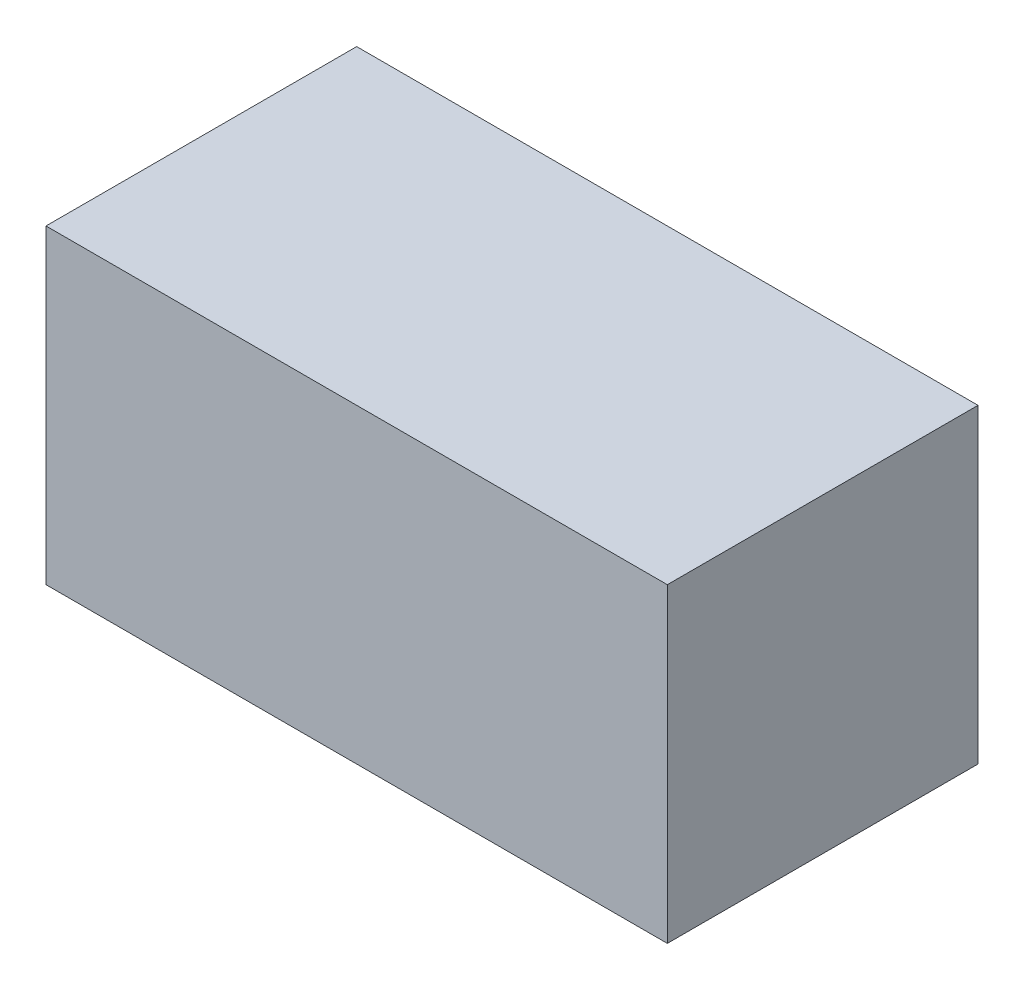
ISO-10303-21;
HEADER;
FILE_DESCRIPTION(('STEP AP214'),'2;1');
FILE_NAME('part.step','',(''),(''),'','','');
FILE_SCHEMA(('AUTOMOTIVE_DESIGN { 1 0 10303 214 1 1 1 1 }'));
ENDSEC;
DATA;
#1=APPLICATION_CONTEXT('core data for automotive mechanical design processes');
#2=APPLICATION_PROTOCOL_DEFINITION('international standard','automotive_design',2000,#1);
#3=PRODUCT_CONTEXT('',#1,'mechanical');
#4=PRODUCT('Part','Part','',(#3));
#5=PRODUCT_RELATED_PRODUCT_CATEGORY('part','',(#4));
#6=PRODUCT_DEFINITION_FORMATION('','',#4);
#7=PRODUCT_DEFINITION_CONTEXT('part definition',#1,'design');
#8=PRODUCT_DEFINITION('design','',#6,#7);
#9=PRODUCT_DEFINITION_SHAPE('','',#8);
#10=(LENGTH_UNIT() NAMED_UNIT(*) SI_UNIT(.MILLI.,.METRE.));
#11=(NAMED_UNIT(*) PLANE_ANGLE_UNIT() SI_UNIT($,.RADIAN.));
#12=(NAMED_UNIT(*) SI_UNIT($,.STERADIAN.) SOLID_ANGLE_UNIT());
#13=UNCERTAINTY_MEASURE_WITH_UNIT(LENGTH_MEASURE(1.E-05),#10,'distance_accuracy_value','');
#14=(GEOMETRIC_REPRESENTATION_CONTEXT(3) GLOBAL_UNCERTAINTY_ASSIGNED_CONTEXT((#13)) GLOBAL_UNIT_ASSIGNED_CONTEXT((#10,
#11,#12)) REPRESENTATION_CONTEXT('',''));
#15=CARTESIAN_POINT('',(0.,0.,0.));
#16=DIRECTION('',(0.,0.,1.));
#17=DIRECTION('',(1.,0.,0.));
#18=AXIS2_PLACEMENT_3D('',#15,#16,#17);
#19=CARTESIAN_POINT('',(15.,15.,-7.5));
#20=DIRECTION('',(-1.,0.,0.));
#21=DIRECTION('',(0.,0.,1.));
#22=AXIS2_PLACEMENT_3D('',#19,#20,#21);
#23=PLANE('',#22);
#24=DIRECTION('',(0.,0.,-1.));
#25=VECTOR('',#24,1.);
#26=CARTESIAN_POINT('',(15.,0.,-7.5));
#27=LINE('',#26,#25);
#28=CARTESIAN_POINT('',(15.,0.,7.5));
#29=VERTEX_POINT('',#28);
#30=CARTESIAN_POINT('',(15.,0.,-7.5));
#31=VERTEX_POINT('',#30);
#32=EDGE_CURVE('E96',#29,#31,#27,.T.);
#33=ORIENTED_EDGE('',*,*,#32,.T.);
#34=DIRECTION('',(0.,-1.,0.));
#35=VECTOR('',#34,1.);
#36=CARTESIAN_POINT('',(15.,15.,-7.5));
#37=LINE('',#36,#35);
#38=CARTESIAN_POINT('',(15.,15.,-7.5));
#39=VERTEX_POINT('',#38);
#40=EDGE_CURVE('E11',#39,#31,#37,.T.);
#41=ORIENTED_EDGE('',*,*,#40,.F.);
#42=DIRECTION('',(0.,0.,-1.));
#43=VECTOR('',#42,1.);
#44=CARTESIAN_POINT('',(15.,15.,-7.5));
#45=LINE('',#44,#43);
#46=CARTESIAN_POINT('',(15.,15.,7.5));
#47=VERTEX_POINT('',#46);
#48=EDGE_CURVE('E84',#47,#39,#45,.T.);
#49=ORIENTED_EDGE('',*,*,#48,.F.);
#50=DIRECTION('',(0.,-1.,0.));
#51=VECTOR('',#50,1.);
#52=CARTESIAN_POINT('',(15.,15.,7.5));
#53=LINE('',#52,#51);
#54=EDGE_CURVE('E92',#47,#29,#53,.T.);
#55=ORIENTED_EDGE('',*,*,#54,.T.);
#56=EDGE_LOOP('',(#33,#41,#49,#55));
#57=FACE_BOUND('',#56,.T.);
#58=ADVANCED_FACE('F33',(#57),#23,.F.);
#59=CARTESIAN_POINT('',(-15.,15.,-7.5));
#60=DIRECTION('',(0.,0.,1.));
#61=DIRECTION('',(1.,0.,0.));
#62=AXIS2_PLACEMENT_3D('',#59,#60,#61);
#63=PLANE('',#62);
#64=DIRECTION('',(-1.,0.,0.));
#65=VECTOR('',#64,1.);
#66=CARTESIAN_POINT('',(-15.,0.,-7.5));
#67=LINE('',#66,#65);
#68=CARTESIAN_POINT('',(-15.,0.,-7.5));
#69=VERTEX_POINT('',#68);
#70=EDGE_CURVE('E88',#31,#69,#67,.T.);
#71=ORIENTED_EDGE('',*,*,#70,.T.);
#72=DIRECTION('',(0.,-1.,0.));
#73=VECTOR('',#72,1.);
#74=CARTESIAN_POINT('',(-15.,15.,-7.5));
#75=LINE('',#74,#73);
#76=CARTESIAN_POINT('',(-15.,15.,-7.5));
#77=VERTEX_POINT('',#76);
#78=EDGE_CURVE('E41',#77,#69,#75,.T.);
#79=ORIENTED_EDGE('',*,*,#78,.F.);
#80=DIRECTION('',(-1.,0.,0.));
#81=VECTOR('',#80,1.);
#82=CARTESIAN_POINT('',(-15.,15.,-7.5));
#83=LINE('',#82,#81);
#84=EDGE_CURVE('E79',#39,#77,#83,.T.);
#85=ORIENTED_EDGE('',*,*,#84,.F.);
#86=ORIENTED_EDGE('',*,*,#40,.T.);
#87=EDGE_LOOP('',(#71,#79,#85,#86));
#88=FACE_BOUND('',#87,.T.);
#89=ADVANCED_FACE('F87',(#88),#63,.F.);
#90=CARTESIAN_POINT('',(-15.,15.,-7.5));
#91=DIRECTION('',(1.,0.,0.));
#92=DIRECTION('',(0.,0.,-1.));
#93=AXIS2_PLACEMENT_3D('',#90,#91,#92);
#94=PLANE('',#93);
#95=DIRECTION('',(0.,0.,1.));
#96=VECTOR('',#95,1.);
#97=CARTESIAN_POINT('',(-15.,0.,-7.5));
#98=LINE('',#97,#96);
#99=CARTESIAN_POINT('',(-15.,0.,7.5));
#100=VERTEX_POINT('',#99);
#101=EDGE_CURVE('E66',#69,#100,#98,.T.);
#102=ORIENTED_EDGE('',*,*,#101,.T.);
#103=DIRECTION('',(0.,-1.,0.));
#104=VECTOR('',#103,1.);
#105=CARTESIAN_POINT('',(-15.,15.,7.5));
#106=LINE('',#105,#104);
#107=CARTESIAN_POINT('',(-15.,15.,7.5));
#108=VERTEX_POINT('',#107);
#109=EDGE_CURVE('E89',#108,#100,#106,.T.);
#110=ORIENTED_EDGE('',*,*,#109,.F.);
#111=DIRECTION('',(0.,0.,1.));
#112=VECTOR('',#111,1.);
#113=CARTESIAN_POINT('',(-15.,15.,-7.5));
#114=LINE('',#113,#112);
#115=EDGE_CURVE('E82',#77,#108,#114,.T.);
#116=ORIENTED_EDGE('',*,*,#115,.F.);
#117=ORIENTED_EDGE('',*,*,#78,.T.);
#118=EDGE_LOOP('',(#102,#110,#116,#117));
#119=FACE_BOUND('',#118,.T.);
#120=ADVANCED_FACE('F90',(#119),#94,.F.);
#121=CARTESIAN_POINT('',(-15.,15.,7.5));
#122=DIRECTION('',(0.,0.,-1.));
#123=DIRECTION('',(-1.,0.,0.));
#124=AXIS2_PLACEMENT_3D('',#121,#122,#123);
#125=PLANE('',#124);
#126=DIRECTION('',(1.,0.,0.));
#127=VECTOR('',#126,1.);
#128=CARTESIAN_POINT('',(-15.,0.,7.5));
#129=LINE('',#128,#127);
#130=EDGE_CURVE('E72',#100,#29,#129,.T.);
#131=ORIENTED_EDGE('',*,*,#130,.T.);
#132=ORIENTED_EDGE('',*,*,#54,.F.);
#133=DIRECTION('',(1.,0.,0.));
#134=VECTOR('',#133,1.);
#135=CARTESIAN_POINT('',(-15.,15.,7.5));
#136=LINE('',#135,#134);
#137=EDGE_CURVE('E49',#108,#47,#136,.T.);
#138=ORIENTED_EDGE('',*,*,#137,.F.);
#139=ORIENTED_EDGE('',*,*,#109,.T.);
#140=EDGE_LOOP('',(#131,#132,#138,#139));
#141=FACE_BOUND('',#140,.T.);
#142=ADVANCED_FACE('F103',(#141),#125,.F.);
#143=CARTESIAN_POINT('',(0.,15.,0.));
#144=DIRECTION('',(0.,1.,0.));
#145=DIRECTION('',(0.,0.,1.));
#146=AXIS2_PLACEMENT_3D('',#143,#144,#145);
#147=PLANE('',#146);
#148=ORIENTED_EDGE('',*,*,#48,.T.);
#149=ORIENTED_EDGE('',*,*,#84,.T.);
#150=ORIENTED_EDGE('',*,*,#115,.T.);
#151=ORIENTED_EDGE('',*,*,#137,.T.);
#152=EDGE_LOOP('',(#148,#149,#150,#151));
#153=FACE_BOUND('',#152,.T.);
#154=ADVANCED_FACE('F80',(#153),#147,.T.);
#155=CARTESIAN_POINT('',(0.,0.,0.));
#156=DIRECTION('',(0.,1.,0.));
#157=DIRECTION('',(0.,0.,1.));
#158=AXIS2_PLACEMENT_3D('',#155,#156,#157);
#159=PLANE('',#158);
#160=ORIENTED_EDGE('',*,*,#32,.F.);
#161=ORIENTED_EDGE('',*,*,#130,.F.);
#162=ORIENTED_EDGE('',*,*,#101,.F.);
#163=ORIENTED_EDGE('',*,*,#70,.F.);
#164=EDGE_LOOP('',(#160,#161,#162,#163));
#165=FACE_BOUND('',#164,.T.);
#166=ADVANCED_FACE('F106',(#165),#159,.F.);
#167=CLOSED_SHELL('',(#58,#89,#120,#142,#154,#166));
#168=MANIFOLD_SOLID_BREP('B2',#167);
#169=ADVANCED_BREP_SHAPE_REPRESENTATION('',(#18,#168),#14);
#170=SHAPE_DEFINITION_REPRESENTATION(#9,#169);
ENDSEC;
END-ISO-10303-21;
